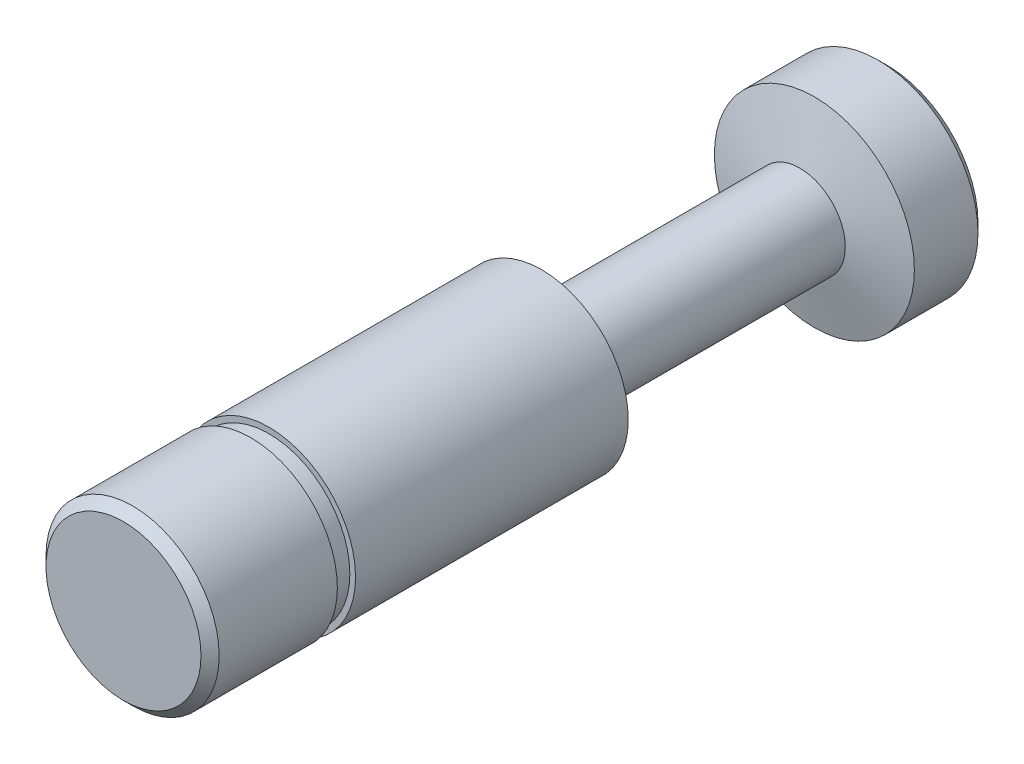
ISO-10303-21;
HEADER;
FILE_DESCRIPTION(('STEP AP214'),'2;1');
FILE_NAME('part.step','',(''),(''),'','','');
FILE_SCHEMA(('AUTOMOTIVE_DESIGN { 1 0 10303 214 1 1 1 1 }'));
ENDSEC;
DATA;
#1=APPLICATION_CONTEXT('core data for automotive mechanical design processes');
#2=APPLICATION_PROTOCOL_DEFINITION('international standard','automotive_design',2000,#1);
#3=PRODUCT_CONTEXT('',#1,'mechanical');
#4=PRODUCT('Part','Part','',(#3));
#5=PRODUCT_RELATED_PRODUCT_CATEGORY('part','',(#4));
#6=PRODUCT_DEFINITION_FORMATION('','',#4);
#7=PRODUCT_DEFINITION_CONTEXT('part definition',#1,'design');
#8=PRODUCT_DEFINITION('design','',#6,#7);
#9=PRODUCT_DEFINITION_SHAPE('','',#8);
#10=(LENGTH_UNIT() NAMED_UNIT(*) SI_UNIT(.MILLI.,.METRE.));
#11=(NAMED_UNIT(*) PLANE_ANGLE_UNIT() SI_UNIT($,.RADIAN.));
#12=(NAMED_UNIT(*) SI_UNIT($,.STERADIAN.) SOLID_ANGLE_UNIT());
#13=UNCERTAINTY_MEASURE_WITH_UNIT(LENGTH_MEASURE(1.E-05),#10,'distance_accuracy_value','');
#14=(GEOMETRIC_REPRESENTATION_CONTEXT(3) GLOBAL_UNCERTAINTY_ASSIGNED_CONTEXT((#13)) GLOBAL_UNIT_ASSIGNED_CONTEXT((#10,
#11,#12)) REPRESENTATION_CONTEXT('',''));
#15=CARTESIAN_POINT('',(0.,0.,0.));
#16=DIRECTION('',(0.,0.,1.));
#17=DIRECTION('',(1.,0.,0.));
#18=AXIS2_PLACEMENT_3D('',#15,#16,#17);
#19=CARTESIAN_POINT('',(0.,0.,-24.31));
#20=DIRECTION('',(0.,0.,1.));
#21=DIRECTION('',(1.,0.,0.));
#22=AXIS2_PLACEMENT_3D('',#19,#20,#21);
#23=CYLINDRICAL_SURFACE('',#22,4.7625);
#24=CARTESIAN_POINT('',(0.,0.,-23.));
#25=DIRECTION('',(0.,0.,1.));
#26=DIRECTION('',(1.,0.,0.));
#27=AXIS2_PLACEMENT_3D('',#24,#25,#26);
#28=CIRCLE('',#27,4.7625);
#29=CARTESIAN_POINT('',(4.7625,0.,-23.));
#30=VERTEX_POINT('',#29);
#31=EDGE_CURVE('E28',#30,#30,#28,.T.);
#32=ORIENTED_EDGE('',*,*,#31,.T.);
#33=EDGE_LOOP('',(#32));
#34=FACE_BOUND('',#33,.T.);
#35=CARTESIAN_POINT('',(0.,0.,-8.));
#36=DIRECTION('',(0.,0.,1.));
#37=DIRECTION('',(1.,0.,0.));
#38=AXIS2_PLACEMENT_3D('',#35,#36,#37);
#39=CIRCLE('',#38,4.7625);
#40=CARTESIAN_POINT('',(4.7625,0.,-8.));
#41=VERTEX_POINT('',#40);
#42=EDGE_CURVE('E39',#41,#41,#39,.F.);
#43=ORIENTED_EDGE('',*,*,#42,.T.);
#44=EDGE_LOOP('',(#43));
#45=FACE_BOUND('',#44,.T.);
#46=ADVANCED_FACE('F13',(#34,#45),#23,.T.);
#47=CARTESIAN_POINT('',(0.,0.,-8.));
#48=DIRECTION('',(0.,0.,1.));
#49=DIRECTION('',(1.,0.,0.));
#50=AXIS2_PLACEMENT_3D('',#47,#48,#49);
#51=PLANE('',#50);
#52=ORIENTED_EDGE('',*,*,#42,.F.);
#53=EDGE_LOOP('',(#52));
#54=FACE_BOUND('',#53,.T.);
#55=CARTESIAN_POINT('',(0.,0.,-8.));
#56=DIRECTION('',(0.,0.,1.));
#57=DIRECTION('',(1.,0.,0.));
#58=AXIS2_PLACEMENT_3D('',#55,#56,#57);
#59=CIRCLE('',#58,4.45);
#60=CARTESIAN_POINT('',(4.45,0.,-8.));
#61=VERTEX_POINT('',#60);
#62=EDGE_CURVE('E45',#61,#61,#59,.T.);
#63=ORIENTED_EDGE('',*,*,#62,.F.);
#64=EDGE_LOOP('',(#63));
#65=FACE_BOUND('',#64,.T.);
#66=ADVANCED_FACE('F76',(#54,#65),#51,.T.);
#67=CARTESIAN_POINT('',(0.,0.,-7.));
#68=DIRECTION('',(0.,0.,1.));
#69=DIRECTION('',(1.,0.,0.));
#70=AXIS2_PLACEMENT_3D('',#67,#68,#69);
#71=PLANE('',#70);
#72=CARTESIAN_POINT('',(0.,0.,-7.));
#73=DIRECTION('',(0.,0.,1.));
#74=DIRECTION('',(1.,0.,0.));
#75=AXIS2_PLACEMENT_3D('',#72,#73,#74);
#76=CIRCLE('',#75,4.7625);
#77=CARTESIAN_POINT('',(4.7625,0.,-7.));
#78=VERTEX_POINT('',#77);
#79=EDGE_CURVE('E42',#78,#78,#76,.F.);
#80=ORIENTED_EDGE('',*,*,#79,.T.);
#81=EDGE_LOOP('',(#80));
#82=FACE_BOUND('',#81,.T.);
#83=CARTESIAN_POINT('',(0.,0.,-7.));
#84=DIRECTION('',(0.,0.,1.));
#85=DIRECTION('',(1.,0.,0.));
#86=AXIS2_PLACEMENT_3D('',#83,#84,#85);
#87=CIRCLE('',#86,4.45);
#88=CARTESIAN_POINT('',(4.45,0.,-7.));
#89=VERTEX_POINT('',#88);
#90=EDGE_CURVE('E46',#89,#89,#87,.T.);
#91=ORIENTED_EDGE('',*,*,#90,.T.);
#92=EDGE_LOOP('',(#91));
#93=FACE_BOUND('',#92,.T.);
#94=ADVANCED_FACE('F83',(#82,#93),#71,.F.);
#95=CARTESIAN_POINT('',(0.,0.,-8.));
#96=DIRECTION('',(0.,0.,1.));
#97=DIRECTION('',(1.,0.,0.));
#98=AXIS2_PLACEMENT_3D('',#95,#96,#97);
#99=CYLINDRICAL_SURFACE('',#98,4.45);
#100=ORIENTED_EDGE('',*,*,#62,.T.);
#101=EDGE_LOOP('',(#100));
#102=FACE_BOUND('',#101,.T.);
#103=ORIENTED_EDGE('',*,*,#90,.F.);
#104=EDGE_LOOP('',(#103));
#105=FACE_BOUND('',#104,.T.);
#106=ADVANCED_FACE('F98',(#102,#105),#99,.T.);
#107=CARTESIAN_POINT('',(0.,0.,0.));
#108=DIRECTION('',(0.,0.,1.));
#109=DIRECTION('',(1.,0.,0.));
#110=AXIS2_PLACEMENT_3D('',#107,#108,#109);
#111=PLANE('',#110);
#112=CARTESIAN_POINT('',(0.,0.,0.));
#113=DIRECTION('',(0.,0.,1.));
#114=DIRECTION('',(1.,0.,0.));
#115=AXIS2_PLACEMENT_3D('',#112,#113,#114);
#116=CIRCLE('',#115,4.2625);
#117=CARTESIAN_POINT('',(4.2625,0.,0.));
#118=VERTEX_POINT('',#117);
#119=EDGE_CURVE('E36',#118,#118,#116,.T.);
#120=ORIENTED_EDGE('',*,*,#119,.T.);
#121=EDGE_LOOP('',(#120));
#122=FACE_BOUND('',#121,.T.);
#123=ADVANCED_FACE('F90',(#122),#111,.T.);
#124=CARTESIAN_POINT('',(0.,0.,-0.5));
#125=DIRECTION('',(0.,0.,1.));
#126=DIRECTION('',(1.,0.,0.));
#127=AXIS2_PLACEMENT_3D('',#124,#125,#126);
#128=CIRCLE('',#127,4.7625);
#129=CARTESIAN_POINT('',(4.7625,0.,-0.5));
#130=VERTEX_POINT('',#129);
#131=EDGE_CURVE('E33',#130,#130,#128,.F.);
#132=ORIENTED_EDGE('',*,*,#131,.T.);
#133=EDGE_LOOP('',(#132));
#134=FACE_BOUND('',#133,.T.);
#135=ORIENTED_EDGE('',*,*,#79,.F.);
#136=EDGE_LOOP('',(#135));
#137=FACE_BOUND('',#136,.T.);
#138=ADVANCED_FACE('F79',(#134,#137),#23,.T.);
#139=CARTESIAN_POINT('',(0.,0.,-37.2));
#140=DIRECTION('',(0.,0.,1.));
#141=DIRECTION('',(1.,0.,0.));
#142=AXIS2_PLACEMENT_3D('',#139,#140,#141);
#143=CYLINDRICAL_SURFACE('',#142,2.5);
#144=CARTESIAN_POINT('',(0.,0.,-37.2));
#145=DIRECTION('',(0.,0.,1.));
#146=DIRECTION('',(1.,0.,0.));
#147=AXIS2_PLACEMENT_3D('',#144,#145,#146);
#148=CIRCLE('',#147,2.5);
#149=CARTESIAN_POINT('',(2.5,0.,-37.2));
#150=VERTEX_POINT('',#149);
#151=EDGE_CURVE('E49',#150,#150,#148,.T.);
#152=ORIENTED_EDGE('',*,*,#151,.T.);
#153=EDGE_LOOP('',(#152));
#154=FACE_BOUND('',#153,.T.);
#155=CARTESIAN_POINT('',(0.,0.,-24.31));
#156=DIRECTION('',(0.,0.,1.));
#157=DIRECTION('',(1.,0.,0.));
#158=AXIS2_PLACEMENT_3D('',#155,#156,#157);
#159=CIRCLE('',#158,2.5);
#160=CARTESIAN_POINT('',(2.5,0.,-24.31));
#161=VERTEX_POINT('',#160);
#162=EDGE_CURVE('E52',#161,#161,#159,.T.);
#163=ORIENTED_EDGE('',*,*,#162,.F.);
#164=EDGE_LOOP('',(#163));
#165=FACE_BOUND('',#164,.T.);
#166=ADVANCED_FACE('F58',(#154,#165),#143,.T.);
#167=CARTESIAN_POINT('',(0.,0.,-42.));
#168=DIRECTION('',(0.,0.,1.));
#169=DIRECTION('',(1.,0.,0.));
#170=AXIS2_PLACEMENT_3D('',#167,#168,#169);
#171=PLANE('',#170);
#172=CARTESIAN_POINT('',(0.,0.,-42.));
#173=DIRECTION('',(0.,0.,1.));
#174=DIRECTION('',(1.,0.,0.));
#175=AXIS2_PLACEMENT_3D('',#172,#173,#174);
#176=CIRCLE('',#175,4.99999999999997);
#177=CARTESIAN_POINT('',(4.99999999999997,0.,-42.));
#178=VERTEX_POINT('',#177);
#179=EDGE_CURVE('E9',#178,#178,#176,.F.);
#180=ORIENTED_EDGE('',*,*,#179,.T.);
#181=EDGE_LOOP('',(#180));
#182=FACE_BOUND('',#181,.T.);
#183=ADVANCED_FACE('F96',(#182),#171,.F.);
#184=CARTESIAN_POINT('',(0.,0.,-42.));
#185=DIRECTION('',(0.,0.,1.));
#186=DIRECTION('',(1.,0.,0.));
#187=AXIS2_PLACEMENT_3D('',#184,#185,#186);
#188=CYLINDRICAL_SURFACE('',#187,5.5);
#189=CARTESIAN_POINT('',(0.,0.,-41.5));
#190=DIRECTION('',(0.,0.,1.));
#191=DIRECTION('',(1.,0.,0.));
#192=AXIS2_PLACEMENT_3D('',#189,#190,#191);
#193=CIRCLE('',#192,5.5);
#194=CARTESIAN_POINT('',(5.5,0.,-41.5));
#195=VERTEX_POINT('',#194);
#196=EDGE_CURVE('E20',#195,#195,#193,.T.);
#197=ORIENTED_EDGE('',*,*,#196,.T.);
#198=EDGE_LOOP('',(#197));
#199=FACE_BOUND('',#198,.T.);
#200=CARTESIAN_POINT('',(0.,0.,-38.));
#201=DIRECTION('',(0.,0.,1.));
#202=DIRECTION('',(1.,0.,0.));
#203=AXIS2_PLACEMENT_3D('',#200,#201,#202);
#204=CIRCLE('',#203,5.5);
#205=CARTESIAN_POINT('',(5.5,0.,-38.));
#206=VERTEX_POINT('',#205);
#207=EDGE_CURVE('E24',#206,#206,#204,.F.);
#208=ORIENTED_EDGE('',*,*,#207,.T.);
#209=EDGE_LOOP('',(#208));
#210=FACE_BOUND('',#209,.T.);
#211=ADVANCED_FACE('F150',(#199,#210),#188,.T.);
#212=CARTESIAN_POINT('',(0.,0.,0.));
#213=DIRECTION('',(0.,0.,-1.));
#214=DIRECTION('',(-1.,0.,0.));
#215=AXIS2_PLACEMENT_3D('',#212,#213,#214);
#216=CONICAL_SURFACE('',#215,4.2625,0.785398163397446);
#217=ORIENTED_EDGE('',*,*,#131,.F.);
#218=EDGE_LOOP('',(#217));
#219=FACE_BOUND('',#218,.T.);
#220=ORIENTED_EDGE('',*,*,#119,.F.);
#221=EDGE_LOOP('',(#220));
#222=FACE_BOUND('',#221,.T.);
#223=ADVANCED_FACE('F71',(#219,#222),#216,.T.);
#224=CARTESIAN_POINT('',(0.,0.,-24.31));
#225=DIRECTION('',(0.,0.,1.));
#226=DIRECTION('',(1.,0.,0.));
#227=AXIS2_PLACEMENT_3D('',#224,#225,#226);
#228=CONICAL_SURFACE('',#227,2.5,1.04595699924082);
#229=ORIENTED_EDGE('',*,*,#31,.F.);
#230=EDGE_LOOP('',(#229));
#231=FACE_BOUND('',#230,.T.);
#232=ORIENTED_EDGE('',*,*,#162,.T.);
#233=EDGE_LOOP('',(#232));
#234=FACE_BOUND('',#233,.T.);
#235=ADVANCED_FACE('F63',(#231,#234),#228,.T.);
#236=CARTESIAN_POINT('',(0.,0.,-37.2));
#237=DIRECTION('',(0.,0.,-1.));
#238=DIRECTION('',(-1.,0.,0.));
#239=AXIS2_PLACEMENT_3D('',#236,#237,#238);
#240=CONICAL_SURFACE('',#239,2.49999999999996,1.31019393504756);
#241=ORIENTED_EDGE('',*,*,#207,.F.);
#242=EDGE_LOOP('',(#241));
#243=FACE_BOUND('',#242,.T.);
#244=ORIENTED_EDGE('',*,*,#151,.F.);
#245=EDGE_LOOP('',(#244));
#246=FACE_BOUND('',#245,.T.);
#247=ADVANCED_FACE('F61',(#243,#246),#240,.T.);
#248=CARTESIAN_POINT('',(0.,0.,-41.5));
#249=DIRECTION('',(0.,0.,1.));
#250=DIRECTION('',(1.,0.,0.));
#251=AXIS2_PLACEMENT_3D('',#248,#249,#250);
#252=CONICAL_SURFACE('',#251,5.5,0.785398163397448);
#253=ORIENTED_EDGE('',*,*,#179,.F.);
#254=EDGE_LOOP('',(#253));
#255=FACE_BOUND('',#254,.T.);
#256=ORIENTED_EDGE('',*,*,#196,.F.);
#257=EDGE_LOOP('',(#256));
#258=FACE_BOUND('',#257,.T.);
#259=ADVANCED_FACE('F15',(#255,#258),#252,.T.);
#260=CLOSED_SHELL('',(#46,#66,#94,#106,#123,#138,#166,#183,#211,#223,#235,#247,#259));
#261=MANIFOLD_SOLID_BREP('B1',#260);
#262=ADVANCED_BREP_SHAPE_REPRESENTATION('',(#18,#261),#14);
#263=SHAPE_DEFINITION_REPRESENTATION(#9,#262);
ENDSEC;
END-ISO-10303-21;
